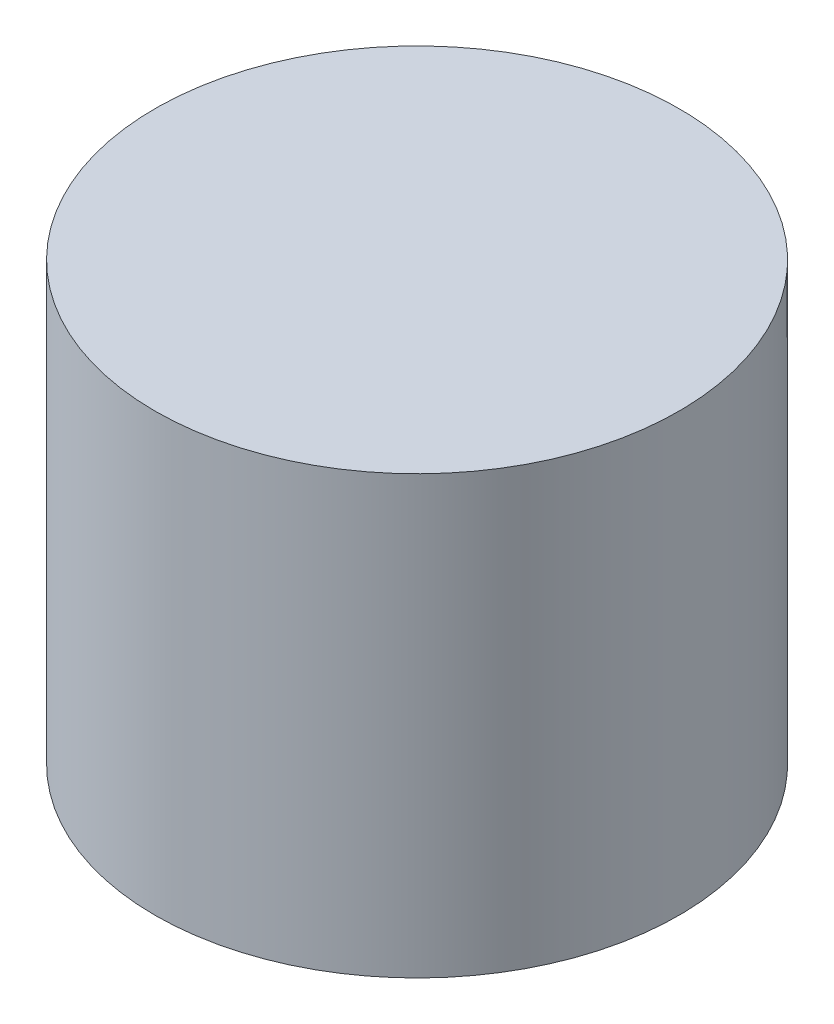
ISO-10303-21;
HEADER;
FILE_DESCRIPTION(('STEP AP214'),'2;1');
FILE_NAME('part.step','',(''),(''),'','','');
FILE_SCHEMA(('AUTOMOTIVE_DESIGN { 1 0 10303 214 1 1 1 1 }'));
ENDSEC;
DATA;
#1=APPLICATION_CONTEXT('core data for automotive mechanical design processes');
#2=APPLICATION_PROTOCOL_DEFINITION('international standard','automotive_design',2000,#1);
#3=PRODUCT_CONTEXT('',#1,'mechanical');
#4=PRODUCT('Part','Part','',(#3));
#5=PRODUCT_RELATED_PRODUCT_CATEGORY('part','',(#4));
#6=PRODUCT_DEFINITION_FORMATION('','',#4);
#7=PRODUCT_DEFINITION_CONTEXT('part definition',#1,'design');
#8=PRODUCT_DEFINITION('design','',#6,#7);
#9=PRODUCT_DEFINITION_SHAPE('','',#8);
#10=(LENGTH_UNIT() NAMED_UNIT(*) SI_UNIT(.MILLI.,.METRE.));
#11=(NAMED_UNIT(*) PLANE_ANGLE_UNIT() SI_UNIT($,.RADIAN.));
#12=(NAMED_UNIT(*) SI_UNIT($,.STERADIAN.) SOLID_ANGLE_UNIT());
#13=UNCERTAINTY_MEASURE_WITH_UNIT(LENGTH_MEASURE(1.E-05),#10,'distance_accuracy_value','');
#14=(GEOMETRIC_REPRESENTATION_CONTEXT(3) GLOBAL_UNCERTAINTY_ASSIGNED_CONTEXT((#13)) GLOBAL_UNIT_ASSIGNED_CONTEXT((#10,
#11,#12)) REPRESENTATION_CONTEXT('',''));
#15=CARTESIAN_POINT('',(0.,0.,0.));
#16=DIRECTION('',(0.,0.,1.));
#17=DIRECTION('',(1.,0.,0.));
#18=AXIS2_PLACEMENT_3D('',#15,#16,#17);
#19=CARTESIAN_POINT('',(0.,12.5,0.));
#20=DIRECTION('',(0.,-1.,0.));
#21=DIRECTION('',(0.,0.,-1.));
#22=AXIS2_PLACEMENT_3D('',#19,#20,#21);
#23=CYLINDRICAL_SURFACE('',#22,7.5);
#24=CARTESIAN_POINT('',(0.,12.5,0.));
#25=DIRECTION('',(0.,1.,0.));
#26=DIRECTION('',(0.,0.,1.));
#27=AXIS2_PLACEMENT_3D('',#24,#25,#26);
#28=CIRCLE('',#27,7.5);
#29=CARTESIAN_POINT('',(0.,12.5,7.5));
#30=VERTEX_POINT('',#29);
#31=EDGE_CURVE('E10',#30,#30,#28,.T.);
#32=ORIENTED_EDGE('',*,*,#31,.F.);
#33=EDGE_LOOP('',(#32));
#34=FACE_BOUND('',#33,.T.);
#35=CARTESIAN_POINT('',(0.,0.,0.));
#36=DIRECTION('',(0.,1.,0.));
#37=DIRECTION('',(0.,0.,1.));
#38=AXIS2_PLACEMENT_3D('',#35,#36,#37);
#39=CIRCLE('',#38,7.5);
#40=CARTESIAN_POINT('',(0.,0.,7.5));
#41=VERTEX_POINT('',#40);
#42=EDGE_CURVE('E44',#41,#41,#39,.T.);
#43=ORIENTED_EDGE('',*,*,#42,.T.);
#44=EDGE_LOOP('',(#43));
#45=FACE_BOUND('',#44,.T.);
#46=ADVANCED_FACE('F41',(#34,#45),#23,.T.);
#47=CARTESIAN_POINT('',(0.,12.5,0.));
#48=DIRECTION('',(0.,1.,0.));
#49=DIRECTION('',(0.,0.,1.));
#50=AXIS2_PLACEMENT_3D('',#47,#48,#49);
#51=PLANE('',#50);
#52=ORIENTED_EDGE('',*,*,#31,.T.);
#53=EDGE_LOOP('',(#52));
#54=FACE_BOUND('',#53,.T.);
#55=ADVANCED_FACE('F58',(#54),#51,.T.);
#56=CARTESIAN_POINT('',(0.,0.,0.));
#57=DIRECTION('',(0.,1.,0.));
#58=DIRECTION('',(0.,0.,1.));
#59=AXIS2_PLACEMENT_3D('',#56,#57,#58);
#60=PLANE('',#59);
#61=ORIENTED_EDGE('',*,*,#42,.F.);
#62=EDGE_LOOP('',(#61));
#63=FACE_BOUND('',#62,.T.);
#64=ADVANCED_FACE('F56',(#63),#60,.F.);
#65=CLOSED_SHELL('',(#46,#55,#64));
#66=MANIFOLD_SOLID_BREP('B2',#65);
#67=ADVANCED_BREP_SHAPE_REPRESENTATION('',(#18,#66),#14);
#68=SHAPE_DEFINITION_REPRESENTATION(#9,#67);
ENDSEC;
END-ISO-10303-21;
